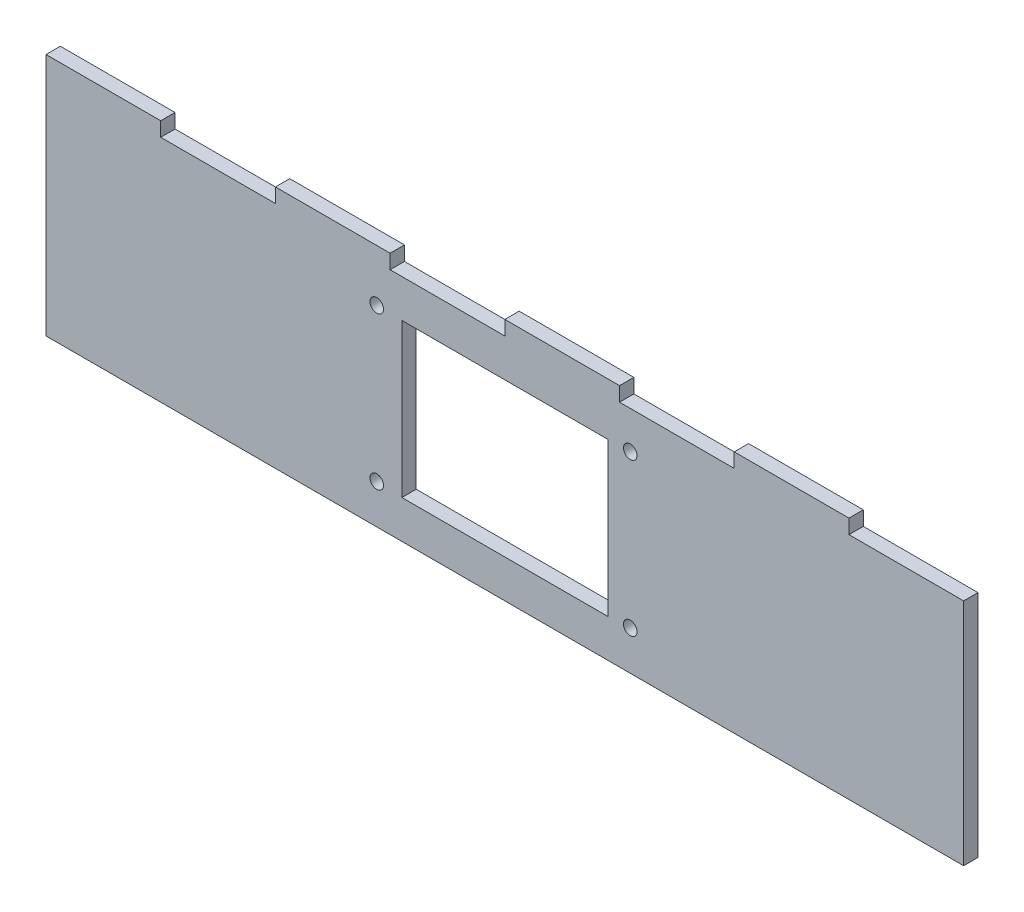
ISO-10303-21;
HEADER;
FILE_DESCRIPTION(('STEP AP214'),'2;1');
FILE_NAME('part.step','',(''),(''),'','','');
FILE_SCHEMA(('AUTOMOTIVE_DESIGN { 1 0 10303 214 1 1 1 1 }'));
ENDSEC;
DATA;
#1=APPLICATION_CONTEXT('core data for automotive mechanical design processes');
#2=APPLICATION_PROTOCOL_DEFINITION('international standard','automotive_design',2000,#1);
#3=PRODUCT_CONTEXT('',#1,'mechanical');
#4=PRODUCT('Part','Part','',(#3));
#5=PRODUCT_RELATED_PRODUCT_CATEGORY('part','',(#4));
#6=PRODUCT_DEFINITION_FORMATION('','',#4);
#7=PRODUCT_DEFINITION_CONTEXT('part definition',#1,'design');
#8=PRODUCT_DEFINITION('design','',#6,#7);
#9=PRODUCT_DEFINITION_SHAPE('','',#8);
#10=(LENGTH_UNIT() NAMED_UNIT(*) SI_UNIT(.MILLI.,.METRE.));
#11=(NAMED_UNIT(*) PLANE_ANGLE_UNIT() SI_UNIT($,.RADIAN.));
#12=(NAMED_UNIT(*) SI_UNIT($,.STERADIAN.) SOLID_ANGLE_UNIT());
#13=UNCERTAINTY_MEASURE_WITH_UNIT(LENGTH_MEASURE(1.E-05),#10,'distance_accuracy_value','');
#14=(GEOMETRIC_REPRESENTATION_CONTEXT(3) GLOBAL_UNCERTAINTY_ASSIGNED_CONTEXT((#13)) GLOBAL_UNIT_ASSIGNED_CONTEXT((#10,
#11,#12)) REPRESENTATION_CONTEXT('',''));
#15=CARTESIAN_POINT('',(0.,0.,0.));
#16=DIRECTION('',(0.,0.,1.));
#17=DIRECTION('',(1.,0.,0.));
#18=AXIS2_PLACEMENT_3D('',#15,#16,#17);
#19=CARTESIAN_POINT('',(-101.6,25.4,3.175));
#20=DIRECTION('',(0.,-1.,0.));
#21=DIRECTION('',(0.,0.,-1.));
#22=AXIS2_PLACEMENT_3D('',#19,#20,#21);
#23=PLANE('',#22);
#24=DIRECTION('',(-1.,0.,0.));
#25=VECTOR('',#24,1.);
#26=CARTESIAN_POINT('',(-101.6,25.4,3.175));
#27=LINE('',#26,#25);
#28=CARTESIAN_POINT('',(50.8,25.4,3.175));
#29=VERTEX_POINT('',#28);
#30=CARTESIAN_POINT('',(25.4,25.4,3.175));
#31=VERTEX_POINT('',#30);
#32=EDGE_CURVE('E52',#29,#31,#27,.T.);
#33=ORIENTED_EDGE('',*,*,#32,.F.);
#34=DIRECTION('',(0.,0.,1.));
#35=VECTOR('',#34,1.);
#36=CARTESIAN_POINT('',(50.8,25.4,0.));
#37=LINE('',#36,#35);
#38=CARTESIAN_POINT('',(50.8,25.4,0.));
#39=VERTEX_POINT('',#38);
#40=EDGE_CURVE('E218',#39,#29,#37,.T.);
#41=ORIENTED_EDGE('',*,*,#40,.F.);
#42=DIRECTION('',(-1.,0.,0.));
#43=VECTOR('',#42,1.);
#44=CARTESIAN_POINT('',(-101.6,25.4,0.));
#45=LINE('',#44,#43);
#46=CARTESIAN_POINT('',(25.4,25.4,0.));
#47=VERTEX_POINT('',#46);
#48=EDGE_CURVE('E372',#39,#47,#45,.T.);
#49=ORIENTED_EDGE('',*,*,#48,.T.);
#50=DIRECTION('',(0.,0.,1.));
#51=VECTOR('',#50,1.);
#52=CARTESIAN_POINT('',(25.4,25.4,0.));
#53=LINE('',#52,#51);
#54=EDGE_CURVE('E233',#47,#31,#53,.T.);
#55=ORIENTED_EDGE('',*,*,#54,.T.);
#56=EDGE_LOOP('',(#33,#41,#49,#55));
#57=FACE_BOUND('',#56,.T.);
#58=ADVANCED_FACE('F37',(#57),#23,.F.);
#59=CARTESIAN_POINT('',(0.,25.4,3.175));
#60=VERTEX_POINT('',#59);
#61=CARTESIAN_POINT('',(-25.4,25.4,3.175));
#62=VERTEX_POINT('',#61);
#63=EDGE_CURVE('E420',#60,#62,#27,.T.);
#64=ORIENTED_EDGE('',*,*,#63,.F.);
#65=DIRECTION('',(0.,0.,1.));
#66=VECTOR('',#65,1.);
#67=CARTESIAN_POINT('',(0.,25.4,0.));
#68=LINE('',#67,#66);
#69=CARTESIAN_POINT('',(0.,25.4,0.));
#70=VERTEX_POINT('',#69);
#71=EDGE_CURVE('E241',#70,#60,#68,.T.);
#72=ORIENTED_EDGE('',*,*,#71,.F.);
#73=CARTESIAN_POINT('',(-25.4,25.4,0.));
#74=VERTEX_POINT('',#73);
#75=EDGE_CURVE('E404',#70,#74,#45,.T.);
#76=ORIENTED_EDGE('',*,*,#75,.T.);
#77=DIRECTION('',(0.,0.,1.));
#78=VECTOR('',#77,1.);
#79=CARTESIAN_POINT('',(-25.4,25.4,0.));
#80=LINE('',#79,#78);
#81=EDGE_CURVE('E260',#74,#62,#80,.T.);
#82=ORIENTED_EDGE('',*,*,#81,.T.);
#83=EDGE_LOOP('',(#64,#72,#76,#82));
#84=FACE_BOUND('',#83,.T.);
#85=ADVANCED_FACE('F431',(#84),#23,.F.);
#86=CARTESIAN_POINT('',(-50.8,25.4,3.175));
#87=VERTEX_POINT('',#86);
#88=CARTESIAN_POINT('',(-76.2,25.4,3.175));
#89=VERTEX_POINT('',#88);
#90=EDGE_CURVE('E357',#87,#89,#27,.T.);
#91=ORIENTED_EDGE('',*,*,#90,.F.);
#92=DIRECTION('',(0.,0.,1.));
#93=VECTOR('',#92,1.);
#94=CARTESIAN_POINT('',(-50.8,25.4,0.));
#95=LINE('',#94,#93);
#96=CARTESIAN_POINT('',(-50.8,25.4,0.));
#97=VERTEX_POINT('',#96);
#98=EDGE_CURVE('E268',#97,#87,#95,.T.);
#99=ORIENTED_EDGE('',*,*,#98,.F.);
#100=CARTESIAN_POINT('',(-76.2,25.4,0.));
#101=VERTEX_POINT('',#100);
#102=EDGE_CURVE('E368',#97,#101,#45,.T.);
#103=ORIENTED_EDGE('',*,*,#102,.T.);
#104=DIRECTION('',(0.,0.,1.));
#105=VECTOR('',#104,1.);
#106=CARTESIAN_POINT('',(-76.2,25.4,0.));
#107=LINE('',#106,#105);
#108=EDGE_CURVE('E285',#101,#89,#107,.T.);
#109=ORIENTED_EDGE('',*,*,#108,.T.);
#110=EDGE_LOOP('',(#91,#99,#103,#109));
#111=FACE_BOUND('',#110,.T.);
#112=ADVANCED_FACE('F403',(#111),#23,.F.);
#113=CARTESIAN_POINT('',(101.6,-25.4,3.175));
#114=DIRECTION('',(-1.,0.,0.));
#115=DIRECTION('',(0.,0.,1.));
#116=AXIS2_PLACEMENT_3D('',#113,#114,#115);
#117=PLANE('',#116);
#118=DIRECTION('',(0.,1.,0.));
#119=VECTOR('',#118,1.);
#120=CARTESIAN_POINT('',(101.6,-25.4,0.));
#121=LINE('',#120,#119);
#122=CARTESIAN_POINT('',(101.6,-25.4,0.));
#123=VERTEX_POINT('',#122);
#124=CARTESIAN_POINT('',(101.6,25.4,0.));
#125=VERTEX_POINT('',#124);
#126=EDGE_CURVE('E347',#123,#125,#121,.T.);
#127=ORIENTED_EDGE('',*,*,#126,.T.);
#128=DIRECTION('',(0.,0.,-1.));
#129=VECTOR('',#128,1.);
#130=CARTESIAN_POINT('',(101.6,25.4,3.175));
#131=LINE('',#130,#129);
#132=CARTESIAN_POINT('',(101.6,25.4,3.175));
#133=VERTEX_POINT('',#132);
#134=EDGE_CURVE('E11',#133,#125,#131,.T.);
#135=ORIENTED_EDGE('',*,*,#134,.F.);
#136=DIRECTION('',(0.,1.,0.));
#137=VECTOR('',#136,1.);
#138=CARTESIAN_POINT('',(101.6,-25.4,3.175));
#139=LINE('',#138,#137);
#140=CARTESIAN_POINT('',(101.6,-25.4,3.175));
#141=VERTEX_POINT('',#140);
#142=EDGE_CURVE('E354',#141,#133,#139,.T.);
#143=ORIENTED_EDGE('',*,*,#142,.F.);
#144=DIRECTION('',(0.,0.,-1.));
#145=VECTOR('',#144,1.);
#146=CARTESIAN_POINT('',(101.6,-25.4,3.175));
#147=LINE('',#146,#145);
#148=EDGE_CURVE('E365',#141,#123,#147,.T.);
#149=ORIENTED_EDGE('',*,*,#148,.T.);
#150=EDGE_LOOP('',(#127,#135,#143,#149));
#151=FACE_BOUND('',#150,.T.);
#152=ADVANCED_FACE('F39',(#151),#117,.F.);
#153=CARTESIAN_POINT('',(76.2,25.4,0.));
#154=VERTEX_POINT('',#153);
#155=EDGE_CURVE('E369',#125,#154,#45,.T.);
#156=ORIENTED_EDGE('',*,*,#155,.T.);
#157=DIRECTION('',(0.,0.,1.));
#158=VECTOR('',#157,1.);
#159=CARTESIAN_POINT('',(76.2,25.4,0.));
#160=LINE('',#159,#158);
#161=CARTESIAN_POINT('',(76.2,25.4,3.175));
#162=VERTEX_POINT('',#161);
#163=EDGE_CURVE('E60',#154,#162,#160,.T.);
#164=ORIENTED_EDGE('',*,*,#163,.T.);
#165=EDGE_CURVE('E359',#133,#162,#27,.T.);
#166=ORIENTED_EDGE('',*,*,#165,.F.);
#167=ORIENTED_EDGE('',*,*,#134,.T.);
#168=EDGE_LOOP('',(#156,#164,#166,#167));
#169=FACE_BOUND('',#168,.T.);
#170=ADVANCED_FACE('F445',(#169),#23,.F.);
#171=CARTESIAN_POINT('',(-101.6,-25.4,3.175));
#172=DIRECTION('',(1.,0.,0.));
#173=DIRECTION('',(0.,0.,-1.));
#174=AXIS2_PLACEMENT_3D('',#171,#172,#173);
#175=PLANE('',#174);
#176=DIRECTION('',(0.,-1.,0.));
#177=VECTOR('',#176,1.);
#178=CARTESIAN_POINT('',(-101.6,-25.4,0.));
#179=LINE('',#178,#177);
#180=CARTESIAN_POINT('',(-101.6,28.575,0.));
#181=VERTEX_POINT('',#180);
#182=CARTESIAN_POINT('',(-101.6,-25.4,0.));
#183=VERTEX_POINT('',#182);
#184=EDGE_CURVE('E371',#181,#183,#179,.T.);
#185=ORIENTED_EDGE('',*,*,#184,.T.);
#186=DIRECTION('',(0.,0.,-1.));
#187=VECTOR('',#186,1.);
#188=CARTESIAN_POINT('',(-101.6,-25.4,3.175));
#189=LINE('',#188,#187);
#190=CARTESIAN_POINT('',(-101.6,-25.4,3.175));
#191=VERTEX_POINT('',#190);
#192=EDGE_CURVE('E45',#191,#183,#189,.T.);
#193=ORIENTED_EDGE('',*,*,#192,.F.);
#194=DIRECTION('',(0.,-1.,0.));
#195=VECTOR('',#194,1.);
#196=CARTESIAN_POINT('',(-101.6,-25.4,3.175));
#197=LINE('',#196,#195);
#198=CARTESIAN_POINT('',(-101.6,28.575,3.175));
#199=VERTEX_POINT('',#198);
#200=EDGE_CURVE('E361',#199,#191,#197,.T.);
#201=ORIENTED_EDGE('',*,*,#200,.F.);
#202=DIRECTION('',(0.,0.,1.));
#203=VECTOR('',#202,1.);
#204=CARTESIAN_POINT('',(-101.6,28.575,0.));
#205=LINE('',#204,#203);
#206=EDGE_CURVE('E290',#181,#199,#205,.T.);
#207=ORIENTED_EDGE('',*,*,#206,.F.);
#208=EDGE_LOOP('',(#185,#193,#201,#207));
#209=FACE_BOUND('',#208,.T.);
#210=ADVANCED_FACE('F392',(#209),#175,.F.);
#211=CARTESIAN_POINT('',(-101.6,-25.4,3.175));
#212=DIRECTION('',(0.,1.,0.));
#213=DIRECTION('',(0.,0.,1.));
#214=AXIS2_PLACEMENT_3D('',#211,#212,#213);
#215=PLANE('',#214);
#216=DIRECTION('',(1.,0.,0.));
#217=VECTOR('',#216,1.);
#218=CARTESIAN_POINT('',(-101.6,-25.4,0.));
#219=LINE('',#218,#217);
#220=EDGE_CURVE('E358',#183,#123,#219,.T.);
#221=ORIENTED_EDGE('',*,*,#220,.T.);
#222=ORIENTED_EDGE('',*,*,#148,.F.);
#223=DIRECTION('',(1.,0.,0.));
#224=VECTOR('',#223,1.);
#225=CARTESIAN_POINT('',(-101.6,-25.4,3.175));
#226=LINE('',#225,#224);
#227=EDGE_CURVE('E363',#191,#141,#226,.T.);
#228=ORIENTED_EDGE('',*,*,#227,.F.);
#229=ORIENTED_EDGE('',*,*,#192,.T.);
#230=EDGE_LOOP('',(#221,#222,#228,#229));
#231=FACE_BOUND('',#230,.T.);
#232=ADVANCED_FACE('F381',(#231),#215,.F.);
#233=CARTESIAN_POINT('',(0.,0.,3.175));
#234=DIRECTION('',(0.,0.,-1.));
#235=DIRECTION('',(-1.,0.,0.));
#236=AXIS2_PLACEMENT_3D('',#233,#234,#235);
#237=PLANE('',#236);
#238=CARTESIAN_POINT('',(27.7690725725974,-16.6992169435274,3.175));
#239=DIRECTION('',(0.,0.,1.));
#240=DIRECTION('',(1.,0.,0.));
#241=AXIS2_PLACEMENT_3D('',#238,#239,#240);
#242=CIRCLE('',#241,1.5);
#243=CARTESIAN_POINT('',(29.2690725725974,-16.6992169435274,3.175));
#244=VERTEX_POINT('',#243);
#245=EDGE_CURVE('E293',#244,#244,#242,.T.);
#246=ORIENTED_EDGE('',*,*,#245,.F.);
#247=EDGE_LOOP('',(#246));
#248=FACE_BOUND('',#247,.T.);
#249=CARTESIAN_POINT('',(-28.3649274274026,-16.6992169435278,3.175));
#250=DIRECTION('',(0.,0.,1.));
#251=DIRECTION('',(1.,0.,0.));
#252=AXIS2_PLACEMENT_3D('',#249,#250,#251);
#253=CIRCLE('',#252,1.5);
#254=CARTESIAN_POINT('',(-26.8649274274026,-16.6992169435278,3.175));
#255=VERTEX_POINT('',#254);
#256=EDGE_CURVE('E314',#255,#255,#253,.T.);
#257=ORIENTED_EDGE('',*,*,#256,.F.);
#258=EDGE_LOOP('',(#257));
#259=FACE_BOUND('',#258,.T.);
#260=CARTESIAN_POINT('',(-28.364927427403,17.0827830564722,3.175));
#261=DIRECTION('',(0.,0.,1.));
#262=DIRECTION('',(1.,0.,0.));
#263=AXIS2_PLACEMENT_3D('',#260,#261,#262);
#264=CIRCLE('',#263,1.5);
#265=CARTESIAN_POINT('',(-26.864927427403,17.0827830564722,3.175));
#266=VERTEX_POINT('',#265);
#267=EDGE_CURVE('E308',#266,#266,#264,.T.);
#268=ORIENTED_EDGE('',*,*,#267,.F.);
#269=EDGE_LOOP('',(#268));
#270=FACE_BOUND('',#269,.T.);
#271=CARTESIAN_POINT('',(27.769072572597,17.0827830564726,3.175));
#272=DIRECTION('',(0.,0.,1.));
#273=DIRECTION('',(1.,0.,0.));
#274=AXIS2_PLACEMENT_3D('',#271,#272,#273);
#275=CIRCLE('',#274,1.5);
#276=CARTESIAN_POINT('',(29.269072572597,17.0827830564726,3.175));
#277=VERTEX_POINT('',#276);
#278=EDGE_CURVE('E302',#277,#277,#275,.T.);
#279=ORIENTED_EDGE('',*,*,#278,.F.);
#280=EDGE_LOOP('',(#279));
#281=FACE_BOUND('',#280,.T.);
#282=DIRECTION('',(-1.,0.,0.));
#283=VECTOR('',#282,1.);
#284=CARTESIAN_POINT('',(-22.8,16.98,3.175));
#285=LINE('',#284,#283);
#286=CARTESIAN_POINT('',(22.8,16.98,3.175));
#287=VERTEX_POINT('',#286);
#288=CARTESIAN_POINT('',(-22.8,16.98,3.175));
#289=VERTEX_POINT('',#288);
#290=EDGE_CURVE('E337',#287,#289,#285,.T.);
#291=ORIENTED_EDGE('',*,*,#290,.F.);
#292=DIRECTION('',(0.,1.,0.));
#293=VECTOR('',#292,1.);
#294=CARTESIAN_POINT('',(22.8,-16.98,3.175));
#295=LINE('',#294,#293);
#296=CARTESIAN_POINT('',(22.8,-16.98,3.175));
#297=VERTEX_POINT('',#296);
#298=EDGE_CURVE('E301',#297,#287,#295,.T.);
#299=ORIENTED_EDGE('',*,*,#298,.F.);
#300=DIRECTION('',(1.,0.,0.));
#301=VECTOR('',#300,1.);
#302=CARTESIAN_POINT('',(-22.8,-16.98,3.175));
#303=LINE('',#302,#301);
#304=CARTESIAN_POINT('',(-22.8,-16.98,3.175));
#305=VERTEX_POINT('',#304);
#306=EDGE_CURVE('E326',#305,#297,#303,.T.);
#307=ORIENTED_EDGE('',*,*,#306,.F.);
#308=DIRECTION('',(0.,-1.,0.));
#309=VECTOR('',#308,1.);
#310=CARTESIAN_POINT('',(-22.8,-16.98,3.175));
#311=LINE('',#310,#309);
#312=EDGE_CURVE('E340',#289,#305,#311,.T.);
#313=ORIENTED_EDGE('',*,*,#312,.F.);
#314=EDGE_LOOP('',(#291,#299,#307,#313));
#315=FACE_BOUND('',#314,.T.);
#316=ORIENTED_EDGE('',*,*,#142,.T.);
#317=ORIENTED_EDGE('',*,*,#165,.T.);
#318=DIRECTION('',(0.,1.,0.));
#319=VECTOR('',#318,1.);
#320=CARTESIAN_POINT('',(76.2,25.4,3.175));
#321=LINE('',#320,#319);
#322=CARTESIAN_POINT('',(76.2,28.575,3.175));
#323=VERTEX_POINT('',#322);
#324=EDGE_CURVE('E215',#162,#323,#321,.T.);
#325=ORIENTED_EDGE('',*,*,#324,.T.);
#326=DIRECTION('',(-1.,0.,0.));
#327=VECTOR('',#326,1.);
#328=CARTESIAN_POINT('',(50.8,28.575,3.175));
#329=LINE('',#328,#327);
#330=CARTESIAN_POINT('',(50.8,28.575,3.175));
#331=VERTEX_POINT('',#330);
#332=EDGE_CURVE('E193',#323,#331,#329,.T.);
#333=ORIENTED_EDGE('',*,*,#332,.T.);
#334=DIRECTION('',(0.,-1.,0.));
#335=VECTOR('',#334,1.);
#336=CARTESIAN_POINT('',(50.8,25.4,3.175));
#337=LINE('',#336,#335);
#338=EDGE_CURVE('E209',#331,#29,#337,.T.);
#339=ORIENTED_EDGE('',*,*,#338,.T.);
#340=ORIENTED_EDGE('',*,*,#32,.T.);
#341=DIRECTION('',(0.,1.,0.));
#342=VECTOR('',#341,1.);
#343=CARTESIAN_POINT('',(25.4,25.4,3.175));
#344=LINE('',#343,#342);
#345=CARTESIAN_POINT('',(25.4,28.575,3.175));
#346=VERTEX_POINT('',#345);
#347=EDGE_CURVE('E220',#31,#346,#344,.T.);
#348=ORIENTED_EDGE('',*,*,#347,.T.);
#349=DIRECTION('',(-1.,0.,0.));
#350=VECTOR('',#349,1.);
#351=CARTESIAN_POINT('',(0.,28.575,3.175));
#352=LINE('',#351,#350);
#353=CARTESIAN_POINT('',(0.,28.575,3.175));
#354=VERTEX_POINT('',#353);
#355=EDGE_CURVE('E236',#346,#354,#352,.T.);
#356=ORIENTED_EDGE('',*,*,#355,.T.);
#357=DIRECTION('',(0.,-1.,0.));
#358=VECTOR('',#357,1.);
#359=CARTESIAN_POINT('',(0.,25.4,3.175));
#360=LINE('',#359,#358);
#361=EDGE_CURVE('E227',#354,#60,#360,.T.);
#362=ORIENTED_EDGE('',*,*,#361,.T.);
#363=ORIENTED_EDGE('',*,*,#63,.T.);
#364=DIRECTION('',(0.,1.,0.));
#365=VECTOR('',#364,1.);
#366=CARTESIAN_POINT('',(-25.4,25.4,3.175));
#367=LINE('',#366,#365);
#368=CARTESIAN_POINT('',(-25.4,28.575,3.175));
#369=VERTEX_POINT('',#368);
#370=EDGE_CURVE('E244',#62,#369,#367,.T.);
#371=ORIENTED_EDGE('',*,*,#370,.T.);
#372=DIRECTION('',(-1.,0.,0.));
#373=VECTOR('',#372,1.);
#374=CARTESIAN_POINT('',(-50.8,28.575,3.175));
#375=LINE('',#374,#373);
#376=CARTESIAN_POINT('',(-50.8,28.575,3.175));
#377=VERTEX_POINT('',#376);
#378=EDGE_CURVE('E263',#369,#377,#375,.T.);
#379=ORIENTED_EDGE('',*,*,#378,.T.);
#380=DIRECTION('',(0.,-1.,0.));
#381=VECTOR('',#380,1.);
#382=CARTESIAN_POINT('',(-50.8,25.4,3.175));
#383=LINE('',#382,#381);
#384=EDGE_CURVE('E254',#377,#87,#383,.T.);
#385=ORIENTED_EDGE('',*,*,#384,.T.);
#386=ORIENTED_EDGE('',*,*,#90,.T.);
#387=DIRECTION('',(0.,1.,0.));
#388=VECTOR('',#387,1.);
#389=CARTESIAN_POINT('',(-76.2,25.4,3.175));
#390=LINE('',#389,#388);
#391=CARTESIAN_POINT('',(-76.2,28.575,3.175));
#392=VERTEX_POINT('',#391);
#393=EDGE_CURVE('E271',#89,#392,#390,.T.);
#394=ORIENTED_EDGE('',*,*,#393,.T.);
#395=DIRECTION('',(-1.,0.,0.));
#396=VECTOR('',#395,1.);
#397=CARTESIAN_POINT('',(-101.6,28.575,3.175));
#398=LINE('',#397,#396);
#399=EDGE_CURVE('E282',#392,#199,#398,.T.);
#400=ORIENTED_EDGE('',*,*,#399,.T.);
#401=ORIENTED_EDGE('',*,*,#200,.T.);
#402=ORIENTED_EDGE('',*,*,#227,.T.);
#403=EDGE_LOOP('',(#316,#317,#325,#333,#339,#340,#348,#356,#362,#363,#371,#379,#385,#386,#394,
#400,#401,#402));
#404=FACE_BOUND('',#403,.T.);
#405=ADVANCED_FACE('F390',(#248,#259,#270,#281,#315,#404),#237,.F.);
#406=CARTESIAN_POINT('',(0.,0.,0.));
#407=DIRECTION('',(0.,0.,-1.));
#408=DIRECTION('',(-1.,0.,0.));
#409=AXIS2_PLACEMENT_3D('',#406,#407,#408);
#410=PLANE('',#409);
#411=CARTESIAN_POINT('',(27.7690725725974,-16.6992169435274,0.));
#412=DIRECTION('',(0.,0.,1.));
#413=DIRECTION('',(1.,0.,0.));
#414=AXIS2_PLACEMENT_3D('',#411,#412,#413);
#415=CIRCLE('',#414,1.5);
#416=CARTESIAN_POINT('',(29.2690725725974,-16.6992169435274,0.));
#417=VERTEX_POINT('',#416);
#418=EDGE_CURVE('E317',#417,#417,#415,.T.);
#419=ORIENTED_EDGE('',*,*,#418,.T.);
#420=EDGE_LOOP('',(#419));
#421=FACE_BOUND('',#420,.T.);
#422=CARTESIAN_POINT('',(-28.3649274274026,-16.6992169435278,0.));
#423=DIRECTION('',(0.,0.,1.));
#424=DIRECTION('',(1.,0.,0.));
#425=AXIS2_PLACEMENT_3D('',#422,#423,#424);
#426=CIRCLE('',#425,1.5);
#427=CARTESIAN_POINT('',(-26.8649274274026,-16.6992169435278,0.));
#428=VERTEX_POINT('',#427);
#429=EDGE_CURVE('E311',#428,#428,#426,.T.);
#430=ORIENTED_EDGE('',*,*,#429,.T.);
#431=EDGE_LOOP('',(#430));
#432=FACE_BOUND('',#431,.T.);
#433=CARTESIAN_POINT('',(-28.364927427403,17.0827830564722,0.));
#434=DIRECTION('',(0.,0.,1.));
#435=DIRECTION('',(1.,0.,0.));
#436=AXIS2_PLACEMENT_3D('',#433,#434,#435);
#437=CIRCLE('',#436,1.5);
#438=CARTESIAN_POINT('',(-26.864927427403,17.0827830564722,0.));
#439=VERTEX_POINT('',#438);
#440=EDGE_CURVE('E305',#439,#439,#437,.T.);
#441=ORIENTED_EDGE('',*,*,#440,.T.);
#442=EDGE_LOOP('',(#441));
#443=FACE_BOUND('',#442,.T.);
#444=CARTESIAN_POINT('',(27.769072572597,17.0827830564726,0.));
#445=DIRECTION('',(0.,0.,1.));
#446=DIRECTION('',(1.,0.,0.));
#447=AXIS2_PLACEMENT_3D('',#444,#445,#446);
#448=CIRCLE('',#447,1.5);
#449=CARTESIAN_POINT('',(29.269072572597,17.0827830564726,0.));
#450=VERTEX_POINT('',#449);
#451=EDGE_CURVE('E298',#450,#450,#448,.T.);
#452=ORIENTED_EDGE('',*,*,#451,.T.);
#453=EDGE_LOOP('',(#452));
#454=FACE_BOUND('',#453,.T.);
#455=DIRECTION('',(0.,1.,0.));
#456=VECTOR('',#455,1.);
#457=CARTESIAN_POINT('',(22.8,-16.98,0.));
#458=LINE('',#457,#456);
#459=CARTESIAN_POINT('',(22.8,-16.98,0.));
#460=VERTEX_POINT('',#459);
#461=CARTESIAN_POINT('',(22.8,16.98,0.));
#462=VERTEX_POINT('',#461);
#463=EDGE_CURVE('E322',#460,#462,#458,.T.);
#464=ORIENTED_EDGE('',*,*,#463,.T.);
#465=DIRECTION('',(-1.,0.,0.));
#466=VECTOR('',#465,1.);
#467=CARTESIAN_POINT('',(-22.8,16.98,0.));
#468=LINE('',#467,#466);
#469=CARTESIAN_POINT('',(-22.8,16.98,0.));
#470=VERTEX_POINT('',#469);
#471=EDGE_CURVE('E325',#462,#470,#468,.T.);
#472=ORIENTED_EDGE('',*,*,#471,.T.);
#473=DIRECTION('',(0.,-1.,0.));
#474=VECTOR('',#473,1.);
#475=CARTESIAN_POINT('',(-22.8,-16.98,0.));
#476=LINE('',#475,#474);
#477=CARTESIAN_POINT('',(-22.8,-16.98,0.));
#478=VERTEX_POINT('',#477);
#479=EDGE_CURVE('E329',#470,#478,#476,.T.);
#480=ORIENTED_EDGE('',*,*,#479,.T.);
#481=DIRECTION('',(1.,0.,0.));
#482=VECTOR('',#481,1.);
#483=CARTESIAN_POINT('',(-22.8,-16.98,0.));
#484=LINE('',#483,#482);
#485=EDGE_CURVE('E332',#478,#460,#484,.T.);
#486=ORIENTED_EDGE('',*,*,#485,.T.);
#487=EDGE_LOOP('',(#464,#472,#480,#486));
#488=FACE_BOUND('',#487,.T.);
#489=ORIENTED_EDGE('',*,*,#126,.F.);
#490=ORIENTED_EDGE('',*,*,#220,.F.);
#491=ORIENTED_EDGE('',*,*,#184,.F.);
#492=DIRECTION('',(-1.,0.,0.));
#493=VECTOR('',#492,1.);
#494=CARTESIAN_POINT('',(-101.6,28.575,0.));
#495=LINE('',#494,#493);
#496=CARTESIAN_POINT('',(-76.2,28.575,0.));
#497=VERTEX_POINT('',#496);
#498=EDGE_CURVE('E281',#497,#181,#495,.T.);
#499=ORIENTED_EDGE('',*,*,#498,.F.);
#500=DIRECTION('',(0.,1.,0.));
#501=VECTOR('',#500,1.);
#502=CARTESIAN_POINT('',(-76.2,25.4,0.));
#503=LINE('',#502,#501);
#504=EDGE_CURVE('E278',#101,#497,#503,.T.);
#505=ORIENTED_EDGE('',*,*,#504,.F.);
#506=ORIENTED_EDGE('',*,*,#102,.F.);
#507=DIRECTION('',(0.,-1.,0.));
#508=VECTOR('',#507,1.);
#509=CARTESIAN_POINT('',(-50.8,25.4,0.));
#510=LINE('',#509,#508);
#511=CARTESIAN_POINT('',(-50.8,28.575,0.));
#512=VERTEX_POINT('',#511);
#513=EDGE_CURVE('E257',#512,#97,#510,.T.);
#514=ORIENTED_EDGE('',*,*,#513,.F.);
#515=DIRECTION('',(-1.,0.,0.));
#516=VECTOR('',#515,1.);
#517=CARTESIAN_POINT('',(-50.8,28.575,0.));
#518=LINE('',#517,#516);
#519=CARTESIAN_POINT('',(-25.4,28.575,0.));
#520=VERTEX_POINT('',#519);
#521=EDGE_CURVE('E253',#520,#512,#518,.T.);
#522=ORIENTED_EDGE('',*,*,#521,.F.);
#523=DIRECTION('',(0.,1.,0.));
#524=VECTOR('',#523,1.);
#525=CARTESIAN_POINT('',(-25.4,25.4,0.));
#526=LINE('',#525,#524);
#527=EDGE_CURVE('E250',#74,#520,#526,.T.);
#528=ORIENTED_EDGE('',*,*,#527,.F.);
#529=ORIENTED_EDGE('',*,*,#75,.F.);
#530=DIRECTION('',(0.,-1.,0.));
#531=VECTOR('',#530,1.);
#532=CARTESIAN_POINT('',(0.,25.4,0.));
#533=LINE('',#532,#531);
#534=CARTESIAN_POINT('',(0.,28.575,0.));
#535=VERTEX_POINT('',#534);
#536=EDGE_CURVE('E230',#535,#70,#533,.T.);
#537=ORIENTED_EDGE('',*,*,#536,.F.);
#538=DIRECTION('',(-1.,0.,0.));
#539=VECTOR('',#538,1.);
#540=CARTESIAN_POINT('',(0.,28.575,0.));
#541=LINE('',#540,#539);
#542=CARTESIAN_POINT('',(25.4,28.575,0.));
#543=VERTEX_POINT('',#542);
#544=EDGE_CURVE('E226',#543,#535,#541,.T.);
#545=ORIENTED_EDGE('',*,*,#544,.F.);
#546=DIRECTION('',(0.,1.,0.));
#547=VECTOR('',#546,1.);
#548=CARTESIAN_POINT('',(25.4,25.4,0.));
#549=LINE('',#548,#547);
#550=EDGE_CURVE('E223',#47,#543,#549,.T.);
#551=ORIENTED_EDGE('',*,*,#550,.F.);
#552=ORIENTED_EDGE('',*,*,#48,.F.);
#553=DIRECTION('',(0.,-1.,0.));
#554=VECTOR('',#553,1.);
#555=CARTESIAN_POINT('',(50.8,25.4,0.));
#556=LINE('',#555,#554);
#557=CARTESIAN_POINT('',(50.8,28.575,0.));
#558=VERTEX_POINT('',#557);
#559=EDGE_CURVE('E206',#558,#39,#556,.T.);
#560=ORIENTED_EDGE('',*,*,#559,.F.);
#561=DIRECTION('',(-1.,0.,0.));
#562=VECTOR('',#561,1.);
#563=CARTESIAN_POINT('',(50.8,28.575,0.));
#564=LINE('',#563,#562);
#565=CARTESIAN_POINT('',(76.2,28.575,0.));
#566=VERTEX_POINT('',#565);
#567=EDGE_CURVE('E190',#566,#558,#564,.T.);
#568=ORIENTED_EDGE('',*,*,#567,.F.);
#569=DIRECTION('',(0.,1.,0.));
#570=VECTOR('',#569,1.);
#571=CARTESIAN_POINT('',(76.2,25.4,0.));
#572=LINE('',#571,#570);
#573=EDGE_CURVE('E204',#154,#566,#572,.T.);
#574=ORIENTED_EDGE('',*,*,#573,.F.);
#575=ORIENTED_EDGE('',*,*,#155,.F.);
#576=EDGE_LOOP('',(#489,#490,#491,#499,#505,#506,#514,#522,#528,#529,#537,#545,#551,#552,#560,
#568,#574,#575));
#577=FACE_BOUND('',#576,.T.);
#578=ADVANCED_FACE('F203',(#421,#432,#443,#454,#488,#577),#410,.T.);
#579=CARTESIAN_POINT('',(22.8,-16.98,0.));
#580=DIRECTION('',(1.,0.,0.));
#581=DIRECTION('',(0.,0.,-1.));
#582=AXIS2_PLACEMENT_3D('',#579,#580,#581);
#583=PLANE('',#582);
#584=ORIENTED_EDGE('',*,*,#298,.T.);
#585=DIRECTION('',(0.,0.,1.));
#586=VECTOR('',#585,1.);
#587=CARTESIAN_POINT('',(22.8,16.98,0.));
#588=LINE('',#587,#586);
#589=EDGE_CURVE('E335',#462,#287,#588,.T.);
#590=ORIENTED_EDGE('',*,*,#589,.F.);
#591=ORIENTED_EDGE('',*,*,#463,.F.);
#592=DIRECTION('',(0.,0.,1.));
#593=VECTOR('',#592,1.);
#594=CARTESIAN_POINT('',(22.8,-16.98,0.));
#595=LINE('',#594,#593);
#596=EDGE_CURVE('E345',#460,#297,#595,.T.);
#597=ORIENTED_EDGE('',*,*,#596,.T.);
#598=EDGE_LOOP('',(#584,#590,#591,#597));
#599=FACE_BOUND('',#598,.T.);
#600=ADVANCED_FACE('F481',(#599),#583,.F.);
#601=CARTESIAN_POINT('',(-22.8,-16.98,0.));
#602=DIRECTION('',(0.,-1.,0.));
#603=DIRECTION('',(0.,0.,-1.));
#604=AXIS2_PLACEMENT_3D('',#601,#602,#603);
#605=PLANE('',#604);
#606=ORIENTED_EDGE('',*,*,#306,.T.);
#607=ORIENTED_EDGE('',*,*,#596,.F.);
#608=ORIENTED_EDGE('',*,*,#485,.F.);
#609=DIRECTION('',(0.,0.,1.));
#610=VECTOR('',#609,1.);
#611=CARTESIAN_POINT('',(-22.8,-16.98,0.));
#612=LINE('',#611,#610);
#613=EDGE_CURVE('E348',#478,#305,#612,.T.);
#614=ORIENTED_EDGE('',*,*,#613,.T.);
#615=EDGE_LOOP('',(#606,#607,#608,#614));
#616=FACE_BOUND('',#615,.T.);
#617=ADVANCED_FACE('F486',(#616),#605,.F.);
#618=CARTESIAN_POINT('',(-22.8,-16.98,0.));
#619=DIRECTION('',(-1.,0.,0.));
#620=DIRECTION('',(0.,0.,1.));
#621=AXIS2_PLACEMENT_3D('',#618,#619,#620);
#622=PLANE('',#621);
#623=ORIENTED_EDGE('',*,*,#312,.T.);
#624=ORIENTED_EDGE('',*,*,#613,.F.);
#625=ORIENTED_EDGE('',*,*,#479,.F.);
#626=DIRECTION('',(0.,0.,1.));
#627=VECTOR('',#626,1.);
#628=CARTESIAN_POINT('',(-22.8,16.98,0.));
#629=LINE('',#628,#627);
#630=EDGE_CURVE('E350',#470,#289,#629,.T.);
#631=ORIENTED_EDGE('',*,*,#630,.T.);
#632=EDGE_LOOP('',(#623,#624,#625,#631));
#633=FACE_BOUND('',#632,.T.);
#634=ADVANCED_FACE('F498',(#633),#622,.F.);
#635=CARTESIAN_POINT('',(-22.8,16.98,0.));
#636=DIRECTION('',(0.,1.,0.));
#637=DIRECTION('',(0.,0.,1.));
#638=AXIS2_PLACEMENT_3D('',#635,#636,#637);
#639=PLANE('',#638);
#640=ORIENTED_EDGE('',*,*,#290,.T.);
#641=ORIENTED_EDGE('',*,*,#630,.F.);
#642=ORIENTED_EDGE('',*,*,#471,.F.);
#643=ORIENTED_EDGE('',*,*,#589,.T.);
#644=EDGE_LOOP('',(#640,#641,#642,#643));
#645=FACE_BOUND('',#644,.T.);
#646=ADVANCED_FACE('F508',(#645),#639,.F.);
#647=CARTESIAN_POINT('',(27.769072572597,17.0827830564726,0.));
#648=DIRECTION('',(0.,0.,1.));
#649=DIRECTION('',(1.,0.,0.));
#650=AXIS2_PLACEMENT_3D('',#647,#648,#649);
#651=CYLINDRICAL_SURFACE('',#650,1.5);
#652=ORIENTED_EDGE('',*,*,#451,.F.);
#653=EDGE_LOOP('',(#652));
#654=FACE_BOUND('',#653,.T.);
#655=ORIENTED_EDGE('',*,*,#278,.T.);
#656=EDGE_LOOP('',(#655));
#657=FACE_BOUND('',#656,.T.);
#658=ADVANCED_FACE('F518',(#654,#657),#651,.F.);
#659=CARTESIAN_POINT('',(-28.364927427403,17.0827830564722,0.));
#660=DIRECTION('',(0.,0.,1.));
#661=DIRECTION('',(1.,0.,0.));
#662=AXIS2_PLACEMENT_3D('',#659,#660,#661);
#663=CYLINDRICAL_SURFACE('',#662,1.5);
#664=ORIENTED_EDGE('',*,*,#440,.F.);
#665=EDGE_LOOP('',(#664));
#666=FACE_BOUND('',#665,.T.);
#667=ORIENTED_EDGE('',*,*,#267,.T.);
#668=EDGE_LOOP('',(#667));
#669=FACE_BOUND('',#668,.T.);
#670=ADVANCED_FACE('F528',(#666,#669),#663,.F.);
#671=CARTESIAN_POINT('',(-28.3649274274026,-16.6992169435278,0.));
#672=DIRECTION('',(0.,0.,1.));
#673=DIRECTION('',(1.,0.,0.));
#674=AXIS2_PLACEMENT_3D('',#671,#672,#673);
#675=CYLINDRICAL_SURFACE('',#674,1.5);
#676=ORIENTED_EDGE('',*,*,#429,.F.);
#677=EDGE_LOOP('',(#676));
#678=FACE_BOUND('',#677,.T.);
#679=ORIENTED_EDGE('',*,*,#256,.T.);
#680=EDGE_LOOP('',(#679));
#681=FACE_BOUND('',#680,.T.);
#682=ADVANCED_FACE('F538',(#678,#681),#675,.F.);
#683=CARTESIAN_POINT('',(27.7690725725974,-16.6992169435274,0.));
#684=DIRECTION('',(0.,0.,1.));
#685=DIRECTION('',(1.,0.,0.));
#686=AXIS2_PLACEMENT_3D('',#683,#684,#685);
#687=CYLINDRICAL_SURFACE('',#686,1.5);
#688=ORIENTED_EDGE('',*,*,#418,.F.);
#689=EDGE_LOOP('',(#688));
#690=FACE_BOUND('',#689,.T.);
#691=ORIENTED_EDGE('',*,*,#245,.T.);
#692=EDGE_LOOP('',(#691));
#693=FACE_BOUND('',#692,.T.);
#694=ADVANCED_FACE('F548',(#690,#693),#687,.F.);
#695=CARTESIAN_POINT('',(-101.6,28.575,0.));
#696=DIRECTION('',(0.,1.,0.));
#697=DIRECTION('',(0.,0.,1.));
#698=AXIS2_PLACEMENT_3D('',#695,#696,#697);
#699=PLANE('',#698);
#700=ORIENTED_EDGE('',*,*,#399,.F.);
#701=DIRECTION('',(0.,0.,1.));
#702=VECTOR('',#701,1.);
#703=CARTESIAN_POINT('',(-76.2,28.575,0.));
#704=LINE('',#703,#702);
#705=EDGE_CURVE('E294',#497,#392,#704,.T.);
#706=ORIENTED_EDGE('',*,*,#705,.F.);
#707=ORIENTED_EDGE('',*,*,#498,.T.);
#708=ORIENTED_EDGE('',*,*,#206,.T.);
#709=EDGE_LOOP('',(#700,#706,#707,#708));
#710=FACE_BOUND('',#709,.T.);
#711=ADVANCED_FACE('F394',(#710),#699,.T.);
#712=CARTESIAN_POINT('',(-76.2,25.4,0.));
#713=DIRECTION('',(1.,0.,0.));
#714=DIRECTION('',(0.,0.,-1.));
#715=AXIS2_PLACEMENT_3D('',#712,#713,#714);
#716=PLANE('',#715);
#717=ORIENTED_EDGE('',*,*,#393,.F.);
#718=ORIENTED_EDGE('',*,*,#108,.F.);
#719=ORIENTED_EDGE('',*,*,#504,.T.);
#720=ORIENTED_EDGE('',*,*,#705,.T.);
#721=EDGE_LOOP('',(#717,#718,#719,#720));
#722=FACE_BOUND('',#721,.T.);
#723=ADVANCED_FACE('F401',(#722),#716,.T.);
#724=CARTESIAN_POINT('',(-50.8,25.4,0.));
#725=DIRECTION('',(-1.,0.,0.));
#726=DIRECTION('',(0.,0.,1.));
#727=AXIS2_PLACEMENT_3D('',#724,#725,#726);
#728=PLANE('',#727);
#729=ORIENTED_EDGE('',*,*,#384,.F.);
#730=DIRECTION('',(0.,0.,1.));
#731=VECTOR('',#730,1.);
#732=CARTESIAN_POINT('',(-50.8,28.575,0.));
#733=LINE('',#732,#731);
#734=EDGE_CURVE('E272',#512,#377,#733,.T.);
#735=ORIENTED_EDGE('',*,*,#734,.F.);
#736=ORIENTED_EDGE('',*,*,#513,.T.);
#737=ORIENTED_EDGE('',*,*,#98,.T.);
#738=EDGE_LOOP('',(#729,#735,#736,#737));
#739=FACE_BOUND('',#738,.T.);
#740=ADVANCED_FACE('F424',(#739),#728,.T.);
#741=CARTESIAN_POINT('',(-50.8,28.575,0.));
#742=DIRECTION('',(0.,1.,0.));
#743=DIRECTION('',(0.,0.,1.));
#744=AXIS2_PLACEMENT_3D('',#741,#742,#743);
#745=PLANE('',#744);
#746=ORIENTED_EDGE('',*,*,#378,.F.);
#747=DIRECTION('',(0.,0.,1.));
#748=VECTOR('',#747,1.);
#749=CARTESIAN_POINT('',(-25.4,28.575,0.));
#750=LINE('',#749,#748);
#751=EDGE_CURVE('E274',#520,#369,#750,.T.);
#752=ORIENTED_EDGE('',*,*,#751,.F.);
#753=ORIENTED_EDGE('',*,*,#521,.T.);
#754=ORIENTED_EDGE('',*,*,#734,.T.);
#755=EDGE_LOOP('',(#746,#752,#753,#754));
#756=FACE_BOUND('',#755,.T.);
#757=ADVANCED_FACE('F441',(#756),#745,.T.);
#758=CARTESIAN_POINT('',(-25.4,25.4,0.));
#759=DIRECTION('',(1.,0.,0.));
#760=DIRECTION('',(0.,0.,-1.));
#761=AXIS2_PLACEMENT_3D('',#758,#759,#760);
#762=PLANE('',#761);
#763=ORIENTED_EDGE('',*,*,#370,.F.);
#764=ORIENTED_EDGE('',*,*,#81,.F.);
#765=ORIENTED_EDGE('',*,*,#527,.T.);
#766=ORIENTED_EDGE('',*,*,#751,.T.);
#767=EDGE_LOOP('',(#763,#764,#765,#766));
#768=FACE_BOUND('',#767,.T.);
#769=ADVANCED_FACE('F430',(#768),#762,.T.);
#770=CARTESIAN_POINT('',(0.,25.4,0.));
#771=DIRECTION('',(-1.,0.,0.));
#772=DIRECTION('',(0.,0.,1.));
#773=AXIS2_PLACEMENT_3D('',#770,#771,#772);
#774=PLANE('',#773);
#775=ORIENTED_EDGE('',*,*,#361,.F.);
#776=DIRECTION('',(0.,0.,1.));
#777=VECTOR('',#776,1.);
#778=CARTESIAN_POINT('',(0.,28.575,0.));
#779=LINE('',#778,#777);
#780=EDGE_CURVE('E245',#535,#354,#779,.T.);
#781=ORIENTED_EDGE('',*,*,#780,.F.);
#782=ORIENTED_EDGE('',*,*,#536,.T.);
#783=ORIENTED_EDGE('',*,*,#71,.T.);
#784=EDGE_LOOP('',(#775,#781,#782,#783));
#785=FACE_BOUND('',#784,.T.);
#786=ADVANCED_FACE('F433',(#785),#774,.T.);
#787=CARTESIAN_POINT('',(0.,28.575,0.));
#788=DIRECTION('',(0.,1.,0.));
#789=DIRECTION('',(0.,0.,1.));
#790=AXIS2_PLACEMENT_3D('',#787,#788,#789);
#791=PLANE('',#790);
#792=ORIENTED_EDGE('',*,*,#355,.F.);
#793=DIRECTION('',(0.,0.,1.));
#794=VECTOR('',#793,1.);
#795=CARTESIAN_POINT('',(25.4,28.575,0.));
#796=LINE('',#795,#794);
#797=EDGE_CURVE('E247',#543,#346,#796,.T.);
#798=ORIENTED_EDGE('',*,*,#797,.F.);
#799=ORIENTED_EDGE('',*,*,#544,.T.);
#800=ORIENTED_EDGE('',*,*,#780,.T.);
#801=EDGE_LOOP('',(#792,#798,#799,#800));
#802=FACE_BOUND('',#801,.T.);
#803=ADVANCED_FACE('F417',(#802),#791,.T.);
#804=CARTESIAN_POINT('',(25.4,25.4,0.));
#805=DIRECTION('',(1.,0.,0.));
#806=DIRECTION('',(0.,0.,-1.));
#807=AXIS2_PLACEMENT_3D('',#804,#805,#806);
#808=PLANE('',#807);
#809=ORIENTED_EDGE('',*,*,#347,.F.);
#810=ORIENTED_EDGE('',*,*,#54,.F.);
#811=ORIENTED_EDGE('',*,*,#550,.T.);
#812=ORIENTED_EDGE('',*,*,#797,.T.);
#813=EDGE_LOOP('',(#809,#810,#811,#812));
#814=FACE_BOUND('',#813,.T.);
#815=ADVANCED_FACE('F412',(#814),#808,.T.);
#816=CARTESIAN_POINT('',(50.8,25.4,0.));
#817=DIRECTION('',(-1.,0.,0.));
#818=DIRECTION('',(0.,0.,1.));
#819=AXIS2_PLACEMENT_3D('',#816,#817,#818);
#820=PLANE('',#819);
#821=ORIENTED_EDGE('',*,*,#338,.F.);
#822=DIRECTION('',(0.,0.,1.));
#823=VECTOR('',#822,1.);
#824=CARTESIAN_POINT('',(50.8,28.575,0.));
#825=LINE('',#824,#823);
#826=EDGE_CURVE('E198',#558,#331,#825,.T.);
#827=ORIENTED_EDGE('',*,*,#826,.F.);
#828=ORIENTED_EDGE('',*,*,#559,.T.);
#829=ORIENTED_EDGE('',*,*,#40,.T.);
#830=EDGE_LOOP('',(#821,#827,#828,#829));
#831=FACE_BOUND('',#830,.T.);
#832=ADVANCED_FACE('F663',(#831),#820,.T.);
#833=CARTESIAN_POINT('',(50.8,28.575,0.));
#834=DIRECTION('',(0.,1.,0.));
#835=DIRECTION('',(0.,0.,1.));
#836=AXIS2_PLACEMENT_3D('',#833,#834,#835);
#837=PLANE('',#836);
#838=ORIENTED_EDGE('',*,*,#332,.F.);
#839=DIRECTION('',(0.,0.,1.));
#840=VECTOR('',#839,1.);
#841=CARTESIAN_POINT('',(76.2,28.575,0.));
#842=LINE('',#841,#840);
#843=EDGE_CURVE('E187',#566,#323,#842,.T.);
#844=ORIENTED_EDGE('',*,*,#843,.F.);
#845=ORIENTED_EDGE('',*,*,#567,.T.);
#846=ORIENTED_EDGE('',*,*,#826,.T.);
#847=EDGE_LOOP('',(#838,#844,#845,#846));
#848=FACE_BOUND('',#847,.T.);
#849=ADVANCED_FACE('F189',(#848),#837,.T.);
#850=CARTESIAN_POINT('',(76.2,25.4,0.));
#851=DIRECTION('',(1.,0.,0.));
#852=DIRECTION('',(0.,0.,-1.));
#853=AXIS2_PLACEMENT_3D('',#850,#851,#852);
#854=PLANE('',#853);
#855=ORIENTED_EDGE('',*,*,#324,.F.);
#856=ORIENTED_EDGE('',*,*,#163,.F.);
#857=ORIENTED_EDGE('',*,*,#573,.T.);
#858=ORIENTED_EDGE('',*,*,#843,.T.);
#859=EDGE_LOOP('',(#855,#856,#857,#858));
#860=FACE_BOUND('',#859,.T.);
#861=ADVANCED_FACE('F208',(#860),#854,.T.);
#862=CLOSED_SHELL('',(#58,#85,#112,#152,#170,#210,#232,#405,#578,#600,#617,#634,#646,#658,#670,
#682,#694,#711,#723,#740,#757,#769,#786,#803,#815,#832,#849,#861));
#863=MANIFOLD_SOLID_BREP('B2',#862);
#864=ADVANCED_BREP_SHAPE_REPRESENTATION('',(#18,#863),#14);
#865=SHAPE_DEFINITION_REPRESENTATION(#9,#864);
ENDSEC;
END-ISO-10303-21;
